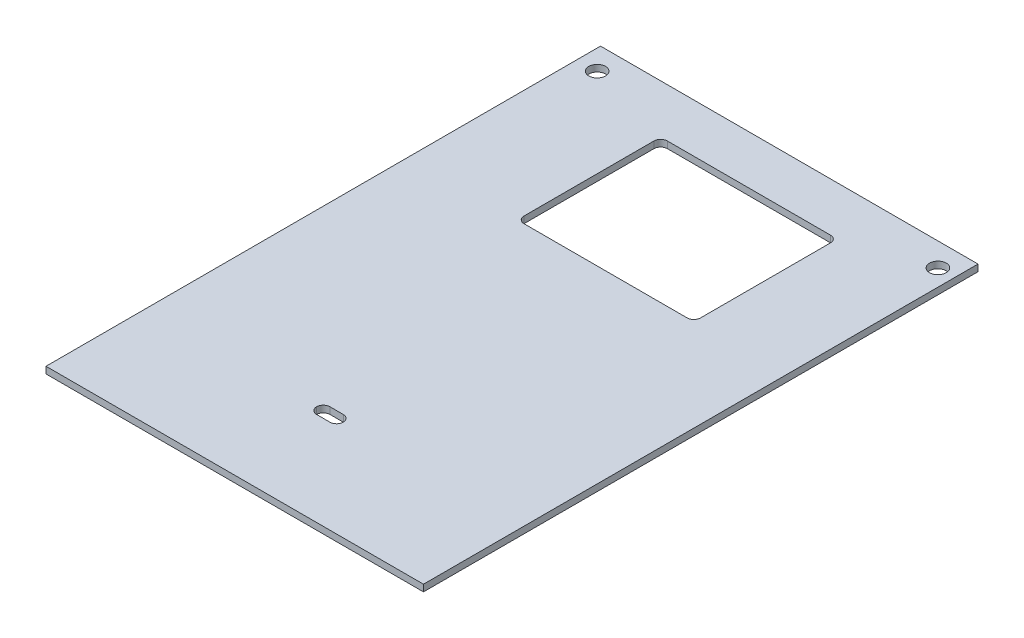
ISO-10303-21;
HEADER;
FILE_DESCRIPTION(('STEP AP214'),'2;1');
FILE_NAME('part.step','',(''),(''),'','','');
FILE_SCHEMA(('AUTOMOTIVE_DESIGN { 1 0 10303 214 1 1 1 1 }'));
ENDSEC;
DATA;
#1=APPLICATION_CONTEXT('core data for automotive mechanical design processes');
#2=APPLICATION_PROTOCOL_DEFINITION('international standard','automotive_design',2000,#1);
#3=PRODUCT_CONTEXT('',#1,'mechanical');
#4=PRODUCT('Part','Part','',(#3));
#5=PRODUCT_RELATED_PRODUCT_CATEGORY('part','',(#4));
#6=PRODUCT_DEFINITION_FORMATION('','',#4);
#7=PRODUCT_DEFINITION_CONTEXT('part definition',#1,'design');
#8=PRODUCT_DEFINITION('design','',#6,#7);
#9=PRODUCT_DEFINITION_SHAPE('','',#8);
#10=(LENGTH_UNIT() NAMED_UNIT(*) SI_UNIT(.MILLI.,.METRE.));
#11=(NAMED_UNIT(*) PLANE_ANGLE_UNIT() SI_UNIT($,.RADIAN.));
#12=(NAMED_UNIT(*) SI_UNIT($,.STERADIAN.) SOLID_ANGLE_UNIT());
#13=UNCERTAINTY_MEASURE_WITH_UNIT(LENGTH_MEASURE(1.E-05),#10,'distance_accuracy_value','');
#14=(GEOMETRIC_REPRESENTATION_CONTEXT(3) GLOBAL_UNCERTAINTY_ASSIGNED_CONTEXT((#13)) GLOBAL_UNIT_ASSIGNED_CONTEXT((#10,
#11,#12)) REPRESENTATION_CONTEXT('',''));
#15=CARTESIAN_POINT('',(0.,0.,0.));
#16=DIRECTION('',(0.,0.,1.));
#17=DIRECTION('',(1.,0.,0.));
#18=AXIS2_PLACEMENT_3D('',#15,#16,#17);
#19=CARTESIAN_POINT('',(-28.5,-10.,15.5796527090027));
#20=DIRECTION('',(0.,0.,-1.));
#21=DIRECTION('',(-1.,0.,0.));
#22=AXIS2_PLACEMENT_3D('',#19,#20,#21);
#23=PLANE('',#22);
#24=CARTESIAN_POINT('',(-24.5,-4.,15.5796527090027));
#25=DIRECTION('',(0.,0.,-1.));
#26=DIRECTION('',(-1.,0.,0.));
#27=AXIS2_PLACEMENT_3D('',#24,#25,#26);
#28=CIRCLE('',#27,2.);
#29=CARTESIAN_POINT('',(-26.5,-4.,15.5796527090027));
#30=VERTEX_POINT('',#29);
#31=EDGE_CURVE('E477',#30,#30,#28,.T.);
#32=ORIENTED_EDGE('',*,*,#31,.T.);
#33=EDGE_LOOP('',(#32));
#34=FACE_BOUND('',#33,.T.);
#35=DIRECTION('',(-1.,0.,0.));
#36=VECTOR('',#35,1.);
#37=CARTESIAN_POINT('',(-28.5,-10.,15.5796527090027));
#38=LINE('',#37,#36);
#39=CARTESIAN_POINT('',(-25.2721157321461,-10.,15.5796527090027));
#40=VERTEX_POINT('',#39);
#41=CARTESIAN_POINT('',(-28.5,-10.,15.5796527090027));
#42=VERTEX_POINT('',#41);
#43=EDGE_CURVE('E444',#40,#42,#38,.T.);
#44=ORIENTED_EDGE('',*,*,#43,.F.);
#45=CARTESIAN_POINT('',(-8.53891520146462,-19.,15.5796527090027));
#46=DIRECTION('',(0.,0.,1.));
#47=DIRECTION('',(1.,0.,0.));
#48=AXIS2_PLACEMENT_3D('',#45,#46,#47);
#49=CIRCLE('',#48,19.);
#50=CARTESIAN_POINT('',(-8.53891520146462,0.,15.5796527090027));
#51=VERTEX_POINT('',#50);
#52=EDGE_CURVE('E211',#51,#40,#49,.T.);
#53=ORIENTED_EDGE('',*,*,#52,.F.);
#54=DIRECTION('',(-1.,0.,0.));
#55=VECTOR('',#54,1.);
#56=CARTESIAN_POINT('',(-28.5,0.,15.5796527090027));
#57=LINE('',#56,#55);
#58=CARTESIAN_POINT('',(-28.5,0.,15.5796527090027));
#59=VERTEX_POINT('',#58);
#60=EDGE_CURVE('E243',#51,#59,#57,.T.);
#61=ORIENTED_EDGE('',*,*,#60,.T.);
#62=DIRECTION('',(0.,1.,0.));
#63=VECTOR('',#62,1.);
#64=CARTESIAN_POINT('',(-28.5,-10.,15.5796527090027));
#65=LINE('',#64,#63);
#66=EDGE_CURVE('E254',#42,#59,#65,.T.);
#67=ORIENTED_EDGE('',*,*,#66,.F.);
#68=EDGE_LOOP('',(#44,#53,#61,#67));
#69=FACE_BOUND('',#68,.T.);
#70=ADVANCED_FACE('F39',(#34,#69),#23,.F.);
#71=CARTESIAN_POINT('',(-28.5,-10.,10.5796527090027));
#72=DIRECTION('',(0.,0.,1.));
#73=DIRECTION('',(1.,0.,0.));
#74=AXIS2_PLACEMENT_3D('',#71,#72,#73);
#75=PLANE('',#74);
#76=CARTESIAN_POINT('',(7.49999999999998,-4.,10.5796527090027));
#77=DIRECTION('',(0.,0.,1.));
#78=DIRECTION('',(1.,0.,0.));
#79=AXIS2_PLACEMENT_3D('',#76,#77,#78);
#80=CIRCLE('',#79,2.);
#81=CARTESIAN_POINT('',(9.49999999999998,-4.,10.5796527090027));
#82=VERTEX_POINT('',#81);
#83=EDGE_CURVE('E216',#82,#82,#80,.F.);
#84=ORIENTED_EDGE('',*,*,#83,.F.);
#85=EDGE_LOOP('',(#84));
#86=FACE_BOUND('',#85,.T.);
#87=DIRECTION('',(1.,0.,0.));
#88=VECTOR('',#87,1.);
#89=CARTESIAN_POINT('',(-28.5,-10.,10.5796527090027));
#90=LINE('',#89,#88);
#91=CARTESIAN_POINT('',(8.19428532921689,-10.,10.5796527090027));
#92=VERTEX_POINT('',#91);
#93=CARTESIAN_POINT('',(11.5,-10.,10.5796527090027));
#94=VERTEX_POINT('',#93);
#95=EDGE_CURVE('E233',#92,#94,#90,.T.);
#96=ORIENTED_EDGE('',*,*,#95,.F.);
#97=CARTESIAN_POINT('',(-8.53891520146462,-19.,10.5796527090027));
#98=DIRECTION('',(0.,0.,1.));
#99=DIRECTION('',(1.,0.,0.));
#100=AXIS2_PLACEMENT_3D('',#97,#98,#99);
#101=CIRCLE('',#100,19.);
#102=CARTESIAN_POINT('',(-8.53891520146462,0.,10.5796527090027));
#103=VERTEX_POINT('',#102);
#104=EDGE_CURVE('E226',#103,#92,#101,.F.);
#105=ORIENTED_EDGE('',*,*,#104,.F.);
#106=DIRECTION('',(1.,0.,0.));
#107=VECTOR('',#106,1.);
#108=CARTESIAN_POINT('',(-28.5,0.,10.5796527090027));
#109=LINE('',#108,#107);
#110=CARTESIAN_POINT('',(11.5,0.,10.5796527090027));
#111=VERTEX_POINT('',#110);
#112=EDGE_CURVE('E250',#103,#111,#109,.T.);
#113=ORIENTED_EDGE('',*,*,#112,.T.);
#114=DIRECTION('',(0.,1.,0.));
#115=VECTOR('',#114,1.);
#116=CARTESIAN_POINT('',(11.5,-10.,10.5796527090027));
#117=LINE('',#116,#115);
#118=EDGE_CURVE('E232',#94,#111,#117,.T.);
#119=ORIENTED_EDGE('',*,*,#118,.F.);
#120=EDGE_LOOP('',(#96,#105,#113,#119));
#121=FACE_BOUND('',#120,.T.);
#122=ADVANCED_FACE('F404',(#86,#121),#75,.F.);
#123=CARTESIAN_POINT('',(0.,-10.,0.));
#124=DIRECTION('',(0.,-1.,0.));
#125=DIRECTION('',(0.,0.,-1.));
#126=AXIS2_PLACEMENT_3D('',#123,#124,#125);
#127=PLANE('',#126);
#128=DIRECTION('',(0.,0.,1.));
#129=VECTOR('',#128,1.);
#130=CARTESIAN_POINT('',(8.19428532921689,-10.,-83.001));
#131=LINE('',#130,#129);
#132=CARTESIAN_POINT('',(8.19428532921689,-10.,15.5796527090027));
#133=VERTEX_POINT('',#132);
#134=EDGE_CURVE('E215',#133,#92,#131,.F.);
#135=ORIENTED_EDGE('',*,*,#134,.T.);
#136=ORIENTED_EDGE('',*,*,#95,.T.);
#137=DIRECTION('',(0.,0.,1.));
#138=VECTOR('',#137,1.);
#139=CARTESIAN_POINT('',(11.5,-10.,15.5796527090027));
#140=LINE('',#139,#138);
#141=CARTESIAN_POINT('',(11.5,-10.,15.5796527090027));
#142=VERTEX_POINT('',#141);
#143=EDGE_CURVE('E251',#94,#142,#140,.T.);
#144=ORIENTED_EDGE('',*,*,#143,.T.);
#145=EDGE_CURVE('E450',#142,#133,#38,.T.);
#146=ORIENTED_EDGE('',*,*,#145,.T.);
#147=EDGE_LOOP('',(#135,#136,#144,#146));
#148=FACE_BOUND('',#147,.T.);
#149=ADVANCED_FACE('F412',(#148),#127,.T.);
#150=CARTESIAN_POINT('',(0.,0.,0.));
#151=DIRECTION('',(0.,1.,0.));
#152=DIRECTION('',(0.,0.,1.));
#153=AXIS2_PLACEMENT_3D('',#150,#151,#152);
#154=PLANE('',#153);
#155=DIRECTION('',(-1.,0.,0.));
#156=VECTOR('',#155,1.);
#157=CARTESIAN_POINT('',(28.9365936068271,0.,-25.5));
#158=LINE('',#157,#156);
#159=CARTESIAN_POINT('',(26.9365936068271,0.,-25.5));
#160=VERTEX_POINT('',#159);
#161=CARTESIAN_POINT('',(-21.9083088951167,0.,-25.5));
#162=VERTEX_POINT('',#161);
#163=EDGE_CURVE('E390',#160,#162,#158,.T.);
#164=ORIENTED_EDGE('',*,*,#163,.F.);
#165=CARTESIAN_POINT('',(26.9365936068271,0.,-27.5));
#166=DIRECTION('',(0.,1.,0.));
#167=DIRECTION('',(0.,0.,1.));
#168=AXIS2_PLACEMENT_3D('',#165,#166,#167);
#169=CIRCLE('',#168,2.);
#170=CARTESIAN_POINT('',(28.9365936068271,0.,-27.5));
#171=VERTEX_POINT('',#170);
#172=EDGE_CURVE('E367',#160,#171,#169,.T.);
#173=ORIENTED_EDGE('',*,*,#172,.T.);
#174=DIRECTION('',(0.,0.,1.));
#175=VECTOR('',#174,1.);
#176=CARTESIAN_POINT('',(28.9365936068271,0.,-68.4141095634092));
#177=LINE('',#176,#175);
#178=CARTESIAN_POINT('',(28.9365936068271,0.,-66.4141095634092));
#179=VERTEX_POINT('',#178);
#180=EDGE_CURVE('E523',#179,#171,#177,.T.);
#181=ORIENTED_EDGE('',*,*,#180,.F.);
#182=CARTESIAN_POINT('',(26.9365936068271,0.,-66.4141095634092));
#183=DIRECTION('',(0.,1.,0.));
#184=DIRECTION('',(0.,0.,1.));
#185=AXIS2_PLACEMENT_3D('',#182,#183,#184);
#186=CIRCLE('',#185,2.);
#187=CARTESIAN_POINT('',(26.9365936068271,0.,-68.4141095634092));
#188=VERTEX_POINT('',#187);
#189=EDGE_CURVE('E371',#179,#188,#186,.T.);
#190=ORIENTED_EDGE('',*,*,#189,.T.);
#191=DIRECTION('',(1.,0.,0.));
#192=VECTOR('',#191,1.);
#193=CARTESIAN_POINT('',(28.9365936068271,0.,-68.4141095634092));
#194=LINE('',#193,#192);
#195=CARTESIAN_POINT('',(-21.9083088951167,0.,-68.4141095634092));
#196=VERTEX_POINT('',#195);
#197=EDGE_CURVE('E386',#196,#188,#194,.T.);
#198=ORIENTED_EDGE('',*,*,#197,.F.);
#199=CARTESIAN_POINT('',(-21.9083088951167,0.,-66.4141095634092));
#200=DIRECTION('',(0.,1.,0.));
#201=DIRECTION('',(0.,0.,1.));
#202=AXIS2_PLACEMENT_3D('',#199,#200,#201);
#203=CIRCLE('',#202,2.);
#204=CARTESIAN_POINT('',(-23.9083088951167,0.,-66.4141095634092));
#205=VERTEX_POINT('',#204);
#206=EDGE_CURVE('E374',#196,#205,#203,.T.);
#207=ORIENTED_EDGE('',*,*,#206,.T.);
#208=DIRECTION('',(0.,0.,-1.));
#209=VECTOR('',#208,1.);
#210=CARTESIAN_POINT('',(-23.9083088951167,0.,-68.4141095634092));
#211=LINE('',#210,#209);
#212=CARTESIAN_POINT('',(-23.9083088951167,0.,-27.5));
#213=VERTEX_POINT('',#212);
#214=EDGE_CURVE('E383',#213,#205,#211,.T.);
#215=ORIENTED_EDGE('',*,*,#214,.F.);
#216=CARTESIAN_POINT('',(-21.9083088951167,0.,-27.5));
#217=DIRECTION('',(0.,1.,0.));
#218=DIRECTION('',(0.,0.,1.));
#219=AXIS2_PLACEMENT_3D('',#216,#217,#218);
#220=CIRCLE('',#219,2.);
#221=EDGE_CURVE('E11',#213,#162,#220,.T.);
#222=ORIENTED_EDGE('',*,*,#221,.T.);
#223=EDGE_LOOP('',(#164,#173,#181,#190,#198,#207,#215,#222));
#224=FACE_BOUND('',#223,.T.);
#225=DIRECTION('',(0.,0.,-1.));
#226=VECTOR('',#225,1.);
#227=CARTESIAN_POINT('',(56.5,0.,-83.));
#228=LINE('',#227,#226);
#229=CARTESIAN_POINT('',(56.5,0.,83.));
#230=VERTEX_POINT('',#229);
#231=CARTESIAN_POINT('',(56.5,0.,-83.));
#232=VERTEX_POINT('',#231);
#233=EDGE_CURVE('E268',#230,#232,#228,.T.);
#234=ORIENTED_EDGE('',*,*,#233,.F.);
#235=DIRECTION('',(1.,0.,0.));
#236=VECTOR('',#235,1.);
#237=CARTESIAN_POINT('',(-56.5,0.,83.));
#238=LINE('',#237,#236);
#239=CARTESIAN_POINT('',(-56.5,0.,83.));
#240=VERTEX_POINT('',#239);
#241=EDGE_CURVE('E291',#240,#230,#238,.T.);
#242=ORIENTED_EDGE('',*,*,#241,.F.);
#243=DIRECTION('',(0.,0.,1.));
#244=VECTOR('',#243,1.);
#245=CARTESIAN_POINT('',(-56.5,0.,-83.));
#246=LINE('',#245,#244);
#247=CARTESIAN_POINT('',(-56.5,0.,-83.));
#248=VERTEX_POINT('',#247);
#249=EDGE_CURVE('E302',#248,#240,#246,.T.);
#250=ORIENTED_EDGE('',*,*,#249,.F.);
#251=DIRECTION('',(-1.,0.,0.));
#252=VECTOR('',#251,1.);
#253=CARTESIAN_POINT('',(-56.5,0.,-83.));
#254=LINE('',#253,#252);
#255=EDGE_CURVE('E300',#232,#248,#254,.T.);
#256=ORIENTED_EDGE('',*,*,#255,.F.);
#257=EDGE_LOOP('',(#234,#242,#250,#256));
#258=FACE_BOUND('',#257,.T.);
#259=CARTESIAN_POINT('',(0.499999999999992,0.,53.));
#260=DIRECTION('',(0.,1.,0.));
#261=DIRECTION('',(0.,0.,1.));
#262=AXIS2_PLACEMENT_3D('',#259,#260,#261);
#263=CIRCLE('',#262,2.);
#264=CARTESIAN_POINT('',(0.499999999999993,0.,55.));
#265=VERTEX_POINT('',#264);
#266=CARTESIAN_POINT('',(2.49999999999999,0.,53.));
#267=VERTEX_POINT('',#266);
#268=EDGE_CURVE('E336',#265,#267,#263,.T.);
#269=ORIENTED_EDGE('',*,*,#268,.T.);
#270=CARTESIAN_POINT('',(0.499999999999992,0.,53.));
#271=DIRECTION('',(0.,1.,0.));
#272=DIRECTION('',(0.,0.,1.));
#273=AXIS2_PLACEMENT_3D('',#270,#271,#272);
#274=CIRCLE('',#273,2.);
#275=CARTESIAN_POINT('',(0.499999999999992,0.,51.));
#276=VERTEX_POINT('',#275);
#277=EDGE_CURVE('E340',#267,#276,#274,.T.);
#278=ORIENTED_EDGE('',*,*,#277,.T.);
#279=DIRECTION('',(1.,0.,0.));
#280=VECTOR('',#279,1.);
#281=CARTESIAN_POINT('',(-5.50000000000001,0.,51.));
#282=LINE('',#281,#280);
#283=CARTESIAN_POINT('',(-3.50000000000001,0.,51.));
#284=VERTEX_POINT('',#283);
#285=EDGE_CURVE('E275',#284,#276,#282,.T.);
#286=ORIENTED_EDGE('',*,*,#285,.F.);
#287=CARTESIAN_POINT('',(-3.50000000000001,0.,53.));
#288=DIRECTION('',(0.,1.,0.));
#289=DIRECTION('',(0.,0.,1.));
#290=AXIS2_PLACEMENT_3D('',#287,#288,#289);
#291=CIRCLE('',#290,2.);
#292=CARTESIAN_POINT('',(-5.50000000000001,0.,53.));
#293=VERTEX_POINT('',#292);
#294=EDGE_CURVE('E332',#284,#293,#291,.T.);
#295=ORIENTED_EDGE('',*,*,#294,.T.);
#296=CARTESIAN_POINT('',(-3.50000000000001,0.,53.));
#297=DIRECTION('',(0.,1.,0.));
#298=DIRECTION('',(0.,0.,1.));
#299=AXIS2_PLACEMENT_3D('',#296,#297,#298);
#300=CIRCLE('',#299,2.);
#301=CARTESIAN_POINT('',(-3.50000000000001,0.,55.));
#302=VERTEX_POINT('',#301);
#303=EDGE_CURVE('E328',#293,#302,#300,.T.);
#304=ORIENTED_EDGE('',*,*,#303,.T.);
#305=DIRECTION('',(-1.,0.,0.));
#306=VECTOR('',#305,1.);
#307=CARTESIAN_POINT('',(-5.50000000000001,0.,55.));
#308=LINE('',#307,#306);
#309=EDGE_CURVE('E272',#265,#302,#308,.T.);
#310=ORIENTED_EDGE('',*,*,#309,.F.);
#311=EDGE_LOOP('',(#269,#278,#286,#295,#304,#310));
#312=FACE_BOUND('',#311,.T.);
#313=CARTESIAN_POINT('',(-50.5,0.,-76.));
#314=DIRECTION('',(0.,1.,0.));
#315=DIRECTION('',(0.,0.,1.));
#316=AXIS2_PLACEMENT_3D('',#313,#314,#315);
#317=CIRCLE('',#316,2.5);
#318=CARTESIAN_POINT('',(-50.5,0.,-73.5));
#319=VERTEX_POINT('',#318);
#320=EDGE_CURVE('E269',#319,#319,#317,.F.);
#321=ORIENTED_EDGE('',*,*,#320,.F.);
#322=EDGE_LOOP('',(#321));
#323=FACE_BOUND('',#322,.T.);
#324=CARTESIAN_POINT('',(51.5,0.,-76.));
#325=DIRECTION('',(0.,1.,0.));
#326=DIRECTION('',(0.,0.,1.));
#327=AXIS2_PLACEMENT_3D('',#324,#325,#326);
#328=CIRCLE('',#327,2.5);
#329=CARTESIAN_POINT('',(51.5,0.,-73.5));
#330=VERTEX_POINT('',#329);
#331=EDGE_CURVE('E264',#330,#330,#328,.F.);
#332=ORIENTED_EDGE('',*,*,#331,.F.);
#333=EDGE_LOOP('',(#332));
#334=FACE_BOUND('',#333,.T.);
#335=DIRECTION('',(0.,0.,1.));
#336=VECTOR('',#335,1.);
#337=CARTESIAN_POINT('',(11.5,0.,15.5796527090027));
#338=LINE('',#337,#336);
#339=CARTESIAN_POINT('',(11.5,0.,15.5796527090027));
#340=VERTEX_POINT('',#339);
#341=EDGE_CURVE('E225',#111,#340,#338,.T.);
#342=ORIENTED_EDGE('',*,*,#341,.F.);
#343=ORIENTED_EDGE('',*,*,#112,.F.);
#344=CARTESIAN_POINT('',(-28.5,0.,10.5796527090027));
#345=VERTEX_POINT('',#344);
#346=EDGE_CURVE('E224',#345,#103,#109,.T.);
#347=ORIENTED_EDGE('',*,*,#346,.F.);
#348=DIRECTION('',(0.,0.,-1.));
#349=VECTOR('',#348,1.);
#350=CARTESIAN_POINT('',(-28.5,0.,15.5796527090027));
#351=LINE('',#350,#349);
#352=EDGE_CURVE('E247',#59,#345,#351,.T.);
#353=ORIENTED_EDGE('',*,*,#352,.F.);
#354=ORIENTED_EDGE('',*,*,#60,.F.);
#355=EDGE_CURVE('E244',#340,#51,#57,.T.);
#356=ORIENTED_EDGE('',*,*,#355,.F.);
#357=EDGE_LOOP('',(#342,#343,#347,#353,#354,#356));
#358=FACE_BOUND('',#357,.T.);
#359=ADVANCED_FACE('F381',(#224,#258,#312,#323,#334,#358),#154,.F.);
#360=CARTESIAN_POINT('',(56.5,2.,-83.));
#361=DIRECTION('',(-1.,0.,0.));
#362=DIRECTION('',(0.,0.,1.));
#363=AXIS2_PLACEMENT_3D('',#360,#361,#362);
#364=PLANE('',#363);
#365=ORIENTED_EDGE('',*,*,#233,.T.);
#366=DIRECTION('',(0.,-1.,0.));
#367=VECTOR('',#366,1.);
#368=CARTESIAN_POINT('',(56.5,2.,-83.));
#369=LINE('',#368,#367);
#370=CARTESIAN_POINT('',(56.5,2.,-83.));
#371=VERTEX_POINT('',#370);
#372=EDGE_CURVE('E313',#371,#232,#369,.T.);
#373=ORIENTED_EDGE('',*,*,#372,.F.);
#374=DIRECTION('',(0.,0.,-1.));
#375=VECTOR('',#374,1.);
#376=CARTESIAN_POINT('',(56.5,2.,-83.));
#377=LINE('',#376,#375);
#378=CARTESIAN_POINT('',(56.5,2.,83.));
#379=VERTEX_POINT('',#378);
#380=EDGE_CURVE('E287',#379,#371,#377,.T.);
#381=ORIENTED_EDGE('',*,*,#380,.F.);
#382=DIRECTION('',(0.,-1.,0.));
#383=VECTOR('',#382,1.);
#384=CARTESIAN_POINT('',(56.5,2.,83.));
#385=LINE('',#384,#383);
#386=EDGE_CURVE('E297',#379,#230,#385,.T.);
#387=ORIENTED_EDGE('',*,*,#386,.T.);
#388=EDGE_LOOP('',(#365,#373,#381,#387));
#389=FACE_BOUND('',#388,.T.);
#390=ADVANCED_FACE('F461',(#389),#364,.F.);
#391=CARTESIAN_POINT('',(-56.5,2.,-83.));
#392=DIRECTION('',(0.,0.,1.));
#393=DIRECTION('',(1.,0.,0.));
#394=AXIS2_PLACEMENT_3D('',#391,#392,#393);
#395=PLANE('',#394);
#396=ORIENTED_EDGE('',*,*,#255,.T.);
#397=DIRECTION('',(0.,-1.,0.));
#398=VECTOR('',#397,1.);
#399=CARTESIAN_POINT('',(-56.5,2.,-83.));
#400=LINE('',#399,#398);
#401=CARTESIAN_POINT('',(-56.5,2.,-83.));
#402=VERTEX_POINT('',#401);
#403=EDGE_CURVE('E310',#402,#248,#400,.T.);
#404=ORIENTED_EDGE('',*,*,#403,.F.);
#405=DIRECTION('',(-1.,0.,0.));
#406=VECTOR('',#405,1.);
#407=CARTESIAN_POINT('',(-56.5,2.,-83.));
#408=LINE('',#407,#406);
#409=EDGE_CURVE('E290',#371,#402,#408,.T.);
#410=ORIENTED_EDGE('',*,*,#409,.F.);
#411=ORIENTED_EDGE('',*,*,#372,.T.);
#412=EDGE_LOOP('',(#396,#404,#410,#411));
#413=FACE_BOUND('',#412,.T.);
#414=ADVANCED_FACE('F559',(#413),#395,.F.);
#415=CARTESIAN_POINT('',(-56.5,2.,-83.));
#416=DIRECTION('',(1.,0.,0.));
#417=DIRECTION('',(0.,0.,-1.));
#418=AXIS2_PLACEMENT_3D('',#415,#416,#417);
#419=PLANE('',#418);
#420=ORIENTED_EDGE('',*,*,#249,.T.);
#421=DIRECTION('',(0.,-1.,0.));
#422=VECTOR('',#421,1.);
#423=CARTESIAN_POINT('',(-56.5,2.,83.));
#424=LINE('',#423,#422);
#425=CARTESIAN_POINT('',(-56.5,2.,83.));
#426=VERTEX_POINT('',#425);
#427=EDGE_CURVE('E307',#426,#240,#424,.T.);
#428=ORIENTED_EDGE('',*,*,#427,.F.);
#429=DIRECTION('',(0.,0.,1.));
#430=VECTOR('',#429,1.);
#431=CARTESIAN_POINT('',(-56.5,2.,-83.));
#432=LINE('',#431,#430);
#433=EDGE_CURVE('E293',#402,#426,#432,.T.);
#434=ORIENTED_EDGE('',*,*,#433,.F.);
#435=ORIENTED_EDGE('',*,*,#403,.T.);
#436=EDGE_LOOP('',(#420,#428,#434,#435));
#437=FACE_BOUND('',#436,.T.);
#438=ADVANCED_FACE('F564',(#437),#419,.F.);
#439=CARTESIAN_POINT('',(-56.5,2.,83.));
#440=DIRECTION('',(0.,0.,-1.));
#441=DIRECTION('',(-1.,0.,0.));
#442=AXIS2_PLACEMENT_3D('',#439,#440,#441);
#443=PLANE('',#442);
#444=ORIENTED_EDGE('',*,*,#241,.T.);
#445=ORIENTED_EDGE('',*,*,#386,.F.);
#446=DIRECTION('',(1.,0.,0.));
#447=VECTOR('',#446,1.);
#448=CARTESIAN_POINT('',(-56.5,2.,83.));
#449=LINE('',#448,#447);
#450=EDGE_CURVE('E295',#426,#379,#449,.T.);
#451=ORIENTED_EDGE('',*,*,#450,.F.);
#452=ORIENTED_EDGE('',*,*,#427,.T.);
#453=EDGE_LOOP('',(#444,#445,#451,#452));
#454=FACE_BOUND('',#453,.T.);
#455=ADVANCED_FACE('F542',(#454),#443,.F.);
#456=CARTESIAN_POINT('',(0.,2.,0.));
#457=DIRECTION('',(0.,1.,0.));
#458=DIRECTION('',(0.,0.,1.));
#459=AXIS2_PLACEMENT_3D('',#456,#457,#458);
#460=PLANE('',#459);
#461=DIRECTION('',(0.,0.,-1.));
#462=VECTOR('',#461,1.);
#463=CARTESIAN_POINT('',(28.9365936068271,2.,-68.4141095634092));
#464=LINE('',#463,#462);
#465=CARTESIAN_POINT('',(28.9365936068271,2.,-27.5));
#466=VERTEX_POINT('',#465);
#467=CARTESIAN_POINT('',(28.9365936068271,2.,-66.4141095634092));
#468=VERTEX_POINT('',#467);
#469=EDGE_CURVE('E528',#466,#468,#464,.T.);
#470=ORIENTED_EDGE('',*,*,#469,.F.);
#471=CARTESIAN_POINT('',(26.9365936068271,2.,-27.5));
#472=DIRECTION('',(0.,1.,0.));
#473=DIRECTION('',(0.,0.,1.));
#474=AXIS2_PLACEMENT_3D('',#471,#472,#473);
#475=CIRCLE('',#474,2.);
#476=CARTESIAN_POINT('',(26.9365936068271,2.,-25.5));
#477=VERTEX_POINT('',#476);
#478=EDGE_CURVE('E365',#466,#477,#475,.F.);
#479=ORIENTED_EDGE('',*,*,#478,.T.);
#480=DIRECTION('',(1.,0.,0.));
#481=VECTOR('',#480,1.);
#482=CARTESIAN_POINT('',(28.9365936068271,2.,-25.5));
#483=LINE('',#482,#481);
#484=CARTESIAN_POINT('',(-21.9083088951167,2.,-25.5));
#485=VERTEX_POINT('',#484);
#486=EDGE_CURVE('E480',#485,#477,#483,.T.);
#487=ORIENTED_EDGE('',*,*,#486,.F.);
#488=CARTESIAN_POINT('',(-21.9083088951167,2.,-27.5));
#489=DIRECTION('',(0.,1.,0.));
#490=DIRECTION('',(0.,0.,1.));
#491=AXIS2_PLACEMENT_3D('',#488,#489,#490);
#492=CIRCLE('',#491,2.);
#493=CARTESIAN_POINT('',(-23.9083088951167,2.,-27.5));
#494=VERTEX_POINT('',#493);
#495=EDGE_CURVE('E47',#485,#494,#492,.F.);
#496=ORIENTED_EDGE('',*,*,#495,.T.);
#497=DIRECTION('',(0.,0.,1.));
#498=VECTOR('',#497,1.);
#499=CARTESIAN_POINT('',(-23.9083088951167,2.,-68.4141095634092));
#500=LINE('',#499,#498);
#501=CARTESIAN_POINT('',(-23.9083088951167,2.,-66.4141095634092));
#502=VERTEX_POINT('',#501);
#503=EDGE_CURVE('E516',#502,#494,#500,.T.);
#504=ORIENTED_EDGE('',*,*,#503,.F.);
#505=CARTESIAN_POINT('',(-21.9083088951167,2.,-66.4141095634092));
#506=DIRECTION('',(0.,1.,0.));
#507=DIRECTION('',(0.,0.,1.));
#508=AXIS2_PLACEMENT_3D('',#505,#506,#507);
#509=CIRCLE('',#508,2.);
#510=CARTESIAN_POINT('',(-21.9083088951167,2.,-68.4141095634092));
#511=VERTEX_POINT('',#510);
#512=EDGE_CURVE('E61',#502,#511,#509,.F.);
#513=ORIENTED_EDGE('',*,*,#512,.T.);
#514=DIRECTION('',(-1.,0.,0.));
#515=VECTOR('',#514,1.);
#516=CARTESIAN_POINT('',(28.9365936068271,2.,-68.4141095634092));
#517=LINE('',#516,#515);
#518=CARTESIAN_POINT('',(26.9365936068271,2.,-68.4141095634092));
#519=VERTEX_POINT('',#518);
#520=EDGE_CURVE('E530',#519,#511,#517,.T.);
#521=ORIENTED_EDGE('',*,*,#520,.F.);
#522=CARTESIAN_POINT('',(26.9365936068271,2.,-66.4141095634092));
#523=DIRECTION('',(0.,1.,0.));
#524=DIRECTION('',(0.,0.,1.));
#525=AXIS2_PLACEMENT_3D('',#522,#523,#524);
#526=CIRCLE('',#525,2.);
#527=EDGE_CURVE('E369',#519,#468,#526,.F.);
#528=ORIENTED_EDGE('',*,*,#527,.T.);
#529=EDGE_LOOP('',(#470,#479,#487,#496,#504,#513,#521,#528));
#530=FACE_BOUND('',#529,.T.);
#531=CARTESIAN_POINT('',(51.5,2.,-76.));
#532=DIRECTION('',(0.,1.,0.));
#533=DIRECTION('',(0.,0.,1.));
#534=AXIS2_PLACEMENT_3D('',#531,#532,#533);
#535=CIRCLE('',#534,2.5);
#536=CARTESIAN_POINT('',(51.5,2.,-73.5));
#537=VERTEX_POINT('',#536);
#538=EDGE_CURVE('E261',#537,#537,#535,.T.);
#539=ORIENTED_EDGE('',*,*,#538,.F.);
#540=EDGE_LOOP('',(#539));
#541=FACE_BOUND('',#540,.T.);
#542=CARTESIAN_POINT('',(-50.5,2.,-76.));
#543=DIRECTION('',(0.,1.,0.));
#544=DIRECTION('',(0.,0.,1.));
#545=AXIS2_PLACEMENT_3D('',#542,#543,#544);
#546=CIRCLE('',#545,2.5);
#547=CARTESIAN_POINT('',(-50.5,2.,-73.5));
#548=VERTEX_POINT('',#547);
#549=EDGE_CURVE('E265',#548,#548,#546,.T.);
#550=ORIENTED_EDGE('',*,*,#549,.F.);
#551=EDGE_LOOP('',(#550));
#552=FACE_BOUND('',#551,.T.);
#553=DIRECTION('',(-1.,0.,0.));
#554=VECTOR('',#553,1.);
#555=CARTESIAN_POINT('',(-5.50000000000001,2.,51.));
#556=LINE('',#555,#554);
#557=CARTESIAN_POINT('',(0.499999999999992,2.,51.));
#558=VERTEX_POINT('',#557);
#559=CARTESIAN_POINT('',(-3.50000000000001,2.,51.));
#560=VERTEX_POINT('',#559);
#561=EDGE_CURVE('E282',#558,#560,#556,.T.);
#562=ORIENTED_EDGE('',*,*,#561,.F.);
#563=CARTESIAN_POINT('',(0.499999999999992,2.,53.));
#564=DIRECTION('',(0.,1.,0.));
#565=DIRECTION('',(0.,0.,1.));
#566=AXIS2_PLACEMENT_3D('',#563,#564,#565);
#567=CIRCLE('',#566,2.);
#568=CARTESIAN_POINT('',(2.49999999999999,2.,53.));
#569=VERTEX_POINT('',#568);
#570=EDGE_CURVE('E338',#558,#569,#567,.F.);
#571=ORIENTED_EDGE('',*,*,#570,.T.);
#572=CARTESIAN_POINT('',(0.499999999999992,2.,53.));
#573=DIRECTION('',(0.,1.,0.));
#574=DIRECTION('',(0.,0.,1.));
#575=AXIS2_PLACEMENT_3D('',#572,#573,#574);
#576=CIRCLE('',#575,2.);
#577=CARTESIAN_POINT('',(0.499999999999993,2.,55.));
#578=VERTEX_POINT('',#577);
#579=EDGE_CURVE('E334',#569,#578,#576,.F.);
#580=ORIENTED_EDGE('',*,*,#579,.T.);
#581=DIRECTION('',(1.,0.,0.));
#582=VECTOR('',#581,1.);
#583=CARTESIAN_POINT('',(-5.50000000000001,2.,55.));
#584=LINE('',#583,#582);
#585=CARTESIAN_POINT('',(-3.50000000000001,2.,55.));
#586=VERTEX_POINT('',#585);
#587=EDGE_CURVE('E278',#586,#578,#584,.T.);
#588=ORIENTED_EDGE('',*,*,#587,.F.);
#589=CARTESIAN_POINT('',(-3.50000000000001,2.,53.));
#590=DIRECTION('',(0.,1.,0.));
#591=DIRECTION('',(0.,0.,1.));
#592=AXIS2_PLACEMENT_3D('',#589,#590,#591);
#593=CIRCLE('',#592,2.);
#594=CARTESIAN_POINT('',(-5.50000000000001,2.,53.));
#595=VERTEX_POINT('',#594);
#596=EDGE_CURVE('E326',#586,#595,#593,.F.);
#597=ORIENTED_EDGE('',*,*,#596,.T.);
#598=CARTESIAN_POINT('',(-3.50000000000001,2.,53.));
#599=DIRECTION('',(0.,1.,0.));
#600=DIRECTION('',(0.,0.,1.));
#601=AXIS2_PLACEMENT_3D('',#598,#599,#600);
#602=CIRCLE('',#601,2.);
#603=EDGE_CURVE('E330',#595,#560,#602,.F.);
#604=ORIENTED_EDGE('',*,*,#603,.T.);
#605=EDGE_LOOP('',(#562,#571,#580,#588,#597,#604));
#606=FACE_BOUND('',#605,.T.);
#607=ORIENTED_EDGE('',*,*,#380,.T.);
#608=ORIENTED_EDGE('',*,*,#409,.T.);
#609=ORIENTED_EDGE('',*,*,#433,.T.);
#610=ORIENTED_EDGE('',*,*,#450,.T.);
#611=EDGE_LOOP('',(#607,#608,#609,#610));
#612=FACE_BOUND('',#611,.T.);
#613=ADVANCED_FACE('F536',(#530,#541,#552,#606,#612),#460,.T.);
#614=CARTESIAN_POINT('',(-5.50000000000001,-0.00100000000000013,55.));
#615=DIRECTION('',(0.,0.,1.));
#616=DIRECTION('',(1.,0.,0.));
#617=AXIS2_PLACEMENT_3D('',#614,#615,#616);
#618=PLANE('',#617);
#619=ORIENTED_EDGE('',*,*,#309,.T.);
#620=DIRECTION('',(0.,1.,0.));
#621=VECTOR('',#620,1.);
#622=CARTESIAN_POINT('',(-3.50000000000001,2.,55.));
#623=LINE('',#622,#621);
#624=EDGE_CURVE('E319',#302,#586,#623,.T.);
#625=ORIENTED_EDGE('',*,*,#624,.T.);
#626=ORIENTED_EDGE('',*,*,#587,.T.);
#627=DIRECTION('',(0.,1.,0.));
#628=VECTOR('',#627,1.);
#629=CARTESIAN_POINT('',(0.499999999999992,0.,55.));
#630=LINE('',#629,#628);
#631=EDGE_CURVE('E316',#578,#265,#630,.F.);
#632=ORIENTED_EDGE('',*,*,#631,.T.);
#633=EDGE_LOOP('',(#619,#625,#626,#632));
#634=FACE_BOUND('',#633,.T.);
#635=ADVANCED_FACE('F541',(#634),#618,.F.);
#636=CARTESIAN_POINT('',(-5.50000000000001,-0.00100000000000013,51.));
#637=DIRECTION('',(0.,0.,-1.));
#638=DIRECTION('',(-1.,0.,0.));
#639=AXIS2_PLACEMENT_3D('',#636,#637,#638);
#640=PLANE('',#639);
#641=ORIENTED_EDGE('',*,*,#561,.T.);
#642=DIRECTION('',(0.,1.,0.));
#643=VECTOR('',#642,1.);
#644=CARTESIAN_POINT('',(-3.50000000000001,0.,51.));
#645=LINE('',#644,#643);
#646=EDGE_CURVE('E324',#560,#284,#645,.F.);
#647=ORIENTED_EDGE('',*,*,#646,.T.);
#648=ORIENTED_EDGE('',*,*,#285,.T.);
#649=DIRECTION('',(0.,1.,0.));
#650=VECTOR('',#649,1.);
#651=CARTESIAN_POINT('',(0.499999999999992,2.,51.));
#652=LINE('',#651,#650);
#653=EDGE_CURVE('E322',#276,#558,#652,.T.);
#654=ORIENTED_EDGE('',*,*,#653,.T.);
#655=EDGE_LOOP('',(#641,#647,#648,#654));
#656=FACE_BOUND('',#655,.T.);
#657=ADVANCED_FACE('F588',(#656),#640,.F.);
#658=CARTESIAN_POINT('',(-50.5,-0.00100000000000013,-76.));
#659=DIRECTION('',(0.,1.,0.));
#660=DIRECTION('',(0.,0.,1.));
#661=AXIS2_PLACEMENT_3D('',#658,#659,#660);
#662=CYLINDRICAL_SURFACE('',#661,2.5);
#663=ORIENTED_EDGE('',*,*,#549,.T.);
#664=EDGE_LOOP('',(#663));
#665=FACE_BOUND('',#664,.T.);
#666=ORIENTED_EDGE('',*,*,#320,.T.);
#667=EDGE_LOOP('',(#666));
#668=FACE_BOUND('',#667,.T.);
#669=ADVANCED_FACE('F578',(#665,#668),#662,.F.);
#670=CARTESIAN_POINT('',(51.5,-0.00100000000000013,-76.));
#671=DIRECTION('',(0.,1.,0.));
#672=DIRECTION('',(0.,0.,1.));
#673=AXIS2_PLACEMENT_3D('',#670,#671,#672);
#674=CYLINDRICAL_SURFACE('',#673,2.5);
#675=ORIENTED_EDGE('',*,*,#538,.T.);
#676=EDGE_LOOP('',(#675));
#677=FACE_BOUND('',#676,.T.);
#678=ORIENTED_EDGE('',*,*,#331,.T.);
#679=EDGE_LOOP('',(#678));
#680=FACE_BOUND('',#679,.T.);
#681=ADVANCED_FACE('F575',(#677,#680),#674,.F.);
#682=CARTESIAN_POINT('',(-3.50000000000001,-0.00100000000000013,53.));
#683=DIRECTION('',(0.,-1.,0.));
#684=DIRECTION('',(0.,0.,-1.));
#685=AXIS2_PLACEMENT_3D('',#682,#683,#684);
#686=CYLINDRICAL_SURFACE('',#685,2.);
#687=DIRECTION('',(0.,1.,0.));
#688=VECTOR('',#687,1.);
#689=CARTESIAN_POINT('',(-5.50000000000001,2.,53.));
#690=LINE('',#689,#688);
#691=EDGE_CURVE('E279',#293,#595,#690,.T.);
#692=ORIENTED_EDGE('',*,*,#691,.F.);
#693=ORIENTED_EDGE('',*,*,#294,.F.);
#694=ORIENTED_EDGE('',*,*,#646,.F.);
#695=ORIENTED_EDGE('',*,*,#603,.F.);
#696=EDGE_LOOP('',(#692,#693,#694,#695));
#697=FACE_BOUND('',#696,.T.);
#698=ADVANCED_FACE('F577',(#697),#686,.F.);
#699=CARTESIAN_POINT('',(-3.50000000000001,-0.00100000000000013,53.));
#700=DIRECTION('',(0.,-1.,0.));
#701=DIRECTION('',(0.,0.,-1.));
#702=AXIS2_PLACEMENT_3D('',#699,#700,#701);
#703=CYLINDRICAL_SURFACE('',#702,2.);
#704=ORIENTED_EDGE('',*,*,#303,.F.);
#705=ORIENTED_EDGE('',*,*,#691,.T.);
#706=ORIENTED_EDGE('',*,*,#596,.F.);
#707=ORIENTED_EDGE('',*,*,#624,.F.);
#708=EDGE_LOOP('',(#704,#705,#706,#707));
#709=FACE_BOUND('',#708,.T.);
#710=ADVANCED_FACE('F585',(#709),#703,.F.);
#711=CARTESIAN_POINT('',(0.499999999999992,-0.00100000000000013,53.));
#712=DIRECTION('',(0.,-1.,0.));
#713=DIRECTION('',(0.,0.,-1.));
#714=AXIS2_PLACEMENT_3D('',#711,#712,#713);
#715=CYLINDRICAL_SURFACE('',#714,2.);
#716=ORIENTED_EDGE('',*,*,#653,.F.);
#717=ORIENTED_EDGE('',*,*,#277,.F.);
#718=DIRECTION('',(0.,1.,0.));
#719=VECTOR('',#718,1.);
#720=CARTESIAN_POINT('',(2.49999999999999,0.,53.));
#721=LINE('',#720,#719);
#722=EDGE_CURVE('E260',#569,#267,#721,.F.);
#723=ORIENTED_EDGE('',*,*,#722,.F.);
#724=ORIENTED_EDGE('',*,*,#570,.F.);
#725=EDGE_LOOP('',(#716,#717,#723,#724));
#726=FACE_BOUND('',#725,.T.);
#727=ADVANCED_FACE('F607',(#726),#715,.F.);
#728=CARTESIAN_POINT('',(0.499999999999992,-0.00100000000000013,53.));
#729=DIRECTION('',(0.,-1.,0.));
#730=DIRECTION('',(0.,0.,-1.));
#731=AXIS2_PLACEMENT_3D('',#728,#729,#730);
#732=CYLINDRICAL_SURFACE('',#731,2.);
#733=ORIENTED_EDGE('',*,*,#268,.F.);
#734=ORIENTED_EDGE('',*,*,#631,.F.);
#735=ORIENTED_EDGE('',*,*,#579,.F.);
#736=ORIENTED_EDGE('',*,*,#722,.T.);
#737=EDGE_LOOP('',(#733,#734,#735,#736));
#738=FACE_BOUND('',#737,.T.);
#739=ADVANCED_FACE('F428',(#738),#732,.F.);
#740=CARTESIAN_POINT('',(11.5,-10.,15.5796527090027));
#741=DIRECTION('',(-1.,0.,0.));
#742=DIRECTION('',(0.,0.,1.));
#743=AXIS2_PLACEMENT_3D('',#740,#741,#742);
#744=PLANE('',#743);
#745=ORIENTED_EDGE('',*,*,#341,.T.);
#746=DIRECTION('',(0.,1.,0.));
#747=VECTOR('',#746,1.);
#748=CARTESIAN_POINT('',(11.5,-10.,15.5796527090027));
#749=LINE('',#748,#747);
#750=EDGE_CURVE('E257',#142,#340,#749,.T.);
#751=ORIENTED_EDGE('',*,*,#750,.F.);
#752=ORIENTED_EDGE('',*,*,#143,.F.);
#753=ORIENTED_EDGE('',*,*,#118,.T.);
#754=EDGE_LOOP('',(#745,#751,#752,#753));
#755=FACE_BOUND('',#754,.T.);
#756=ADVANCED_FACE('F421',(#755),#744,.F.);
#757=CARTESIAN_POINT('',(7.49999999999998,-4.,15.5796527090027));
#758=DIRECTION('',(0.,0.,1.));
#759=DIRECTION('',(1.,0.,0.));
#760=AXIS2_PLACEMENT_3D('',#757,#758,#759);
#761=CIRCLE('',#760,2.);
#762=CARTESIAN_POINT('',(9.49999999999998,-4.,15.5796527090027));
#763=VERTEX_POINT('',#762);
#764=EDGE_CURVE('E433',#763,#763,#761,.T.);
#765=ORIENTED_EDGE('',*,*,#764,.F.);
#766=EDGE_LOOP('',(#765));
#767=FACE_BOUND('',#766,.T.);
#768=ORIENTED_EDGE('',*,*,#355,.T.);
#769=EDGE_CURVE('E435',#133,#51,#49,.T.);
#770=ORIENTED_EDGE('',*,*,#769,.F.);
#771=ORIENTED_EDGE('',*,*,#145,.F.);
#772=ORIENTED_EDGE('',*,*,#750,.T.);
#773=EDGE_LOOP('',(#768,#770,#771,#772));
#774=FACE_BOUND('',#773,.T.);
#775=ADVANCED_FACE('F407',(#767,#774),#23,.F.);
#776=CARTESIAN_POINT('',(-28.5,-10.,15.5796527090027));
#777=DIRECTION('',(1.,0.,0.));
#778=DIRECTION('',(0.,0.,-1.));
#779=AXIS2_PLACEMENT_3D('',#776,#777,#778);
#780=PLANE('',#779);
#781=ORIENTED_EDGE('',*,*,#352,.T.);
#782=DIRECTION('',(0.,1.,0.));
#783=VECTOR('',#782,1.);
#784=CARTESIAN_POINT('',(-28.5,-10.,10.5796527090027));
#785=LINE('',#784,#783);
#786=CARTESIAN_POINT('',(-28.5,-10.,10.5796527090027));
#787=VERTEX_POINT('',#786);
#788=EDGE_CURVE('E236',#787,#345,#785,.T.);
#789=ORIENTED_EDGE('',*,*,#788,.F.);
#790=DIRECTION('',(0.,0.,-1.));
#791=VECTOR('',#790,1.);
#792=CARTESIAN_POINT('',(-28.5,-10.,15.5796527090027));
#793=LINE('',#792,#791);
#794=EDGE_CURVE('E230',#42,#787,#793,.T.);
#795=ORIENTED_EDGE('',*,*,#794,.F.);
#796=ORIENTED_EDGE('',*,*,#66,.T.);
#797=EDGE_LOOP('',(#781,#789,#795,#796));
#798=FACE_BOUND('',#797,.T.);
#799=ADVANCED_FACE('F420',(#798),#780,.F.);
#800=CARTESIAN_POINT('',(-24.5,-4.,10.5796527090027));
#801=DIRECTION('',(0.,0.,1.));
#802=DIRECTION('',(1.,0.,0.));
#803=AXIS2_PLACEMENT_3D('',#800,#801,#802);
#804=CIRCLE('',#803,2.);
#805=CARTESIAN_POINT('',(-22.5,-4.,10.5796527090027));
#806=VERTEX_POINT('',#805);
#807=EDGE_CURVE('E475',#806,#806,#804,.T.);
#808=ORIENTED_EDGE('',*,*,#807,.T.);
#809=EDGE_LOOP('',(#808));
#810=FACE_BOUND('',#809,.T.);
#811=ORIENTED_EDGE('',*,*,#346,.T.);
#812=CARTESIAN_POINT('',(-25.2721157321461,-10.,10.5796527090027));
#813=VERTEX_POINT('',#812);
#814=EDGE_CURVE('E208',#813,#103,#101,.F.);
#815=ORIENTED_EDGE('',*,*,#814,.F.);
#816=EDGE_CURVE('E223',#787,#813,#90,.T.);
#817=ORIENTED_EDGE('',*,*,#816,.F.);
#818=ORIENTED_EDGE('',*,*,#788,.T.);
#819=EDGE_LOOP('',(#811,#815,#817,#818));
#820=FACE_BOUND('',#819,.T.);
#821=ADVANCED_FACE('F221',(#810,#820),#75,.F.);
#822=DIRECTION('',(0.,0.,1.));
#823=VECTOR('',#822,1.);
#824=CARTESIAN_POINT('',(-25.2721157321461,-10.,-83.001));
#825=LINE('',#824,#823);
#826=EDGE_CURVE('E205',#813,#40,#825,.T.);
#827=ORIENTED_EDGE('',*,*,#826,.T.);
#828=ORIENTED_EDGE('',*,*,#43,.T.);
#829=ORIENTED_EDGE('',*,*,#794,.T.);
#830=ORIENTED_EDGE('',*,*,#816,.T.);
#831=EDGE_LOOP('',(#827,#828,#829,#830));
#832=FACE_BOUND('',#831,.T.);
#833=ADVANCED_FACE('F228',(#832),#127,.T.);
#834=CARTESIAN_POINT('',(-8.53891520146462,-19.,-83.001));
#835=DIRECTION('',(0.,0.,1.));
#836=DIRECTION('',(1.,0.,0.));
#837=AXIS2_PLACEMENT_3D('',#834,#835,#836);
#838=CYLINDRICAL_SURFACE('',#837,19.);
#839=ORIENTED_EDGE('',*,*,#134,.F.);
#840=ORIENTED_EDGE('',*,*,#769,.T.);
#841=ORIENTED_EDGE('',*,*,#52,.T.);
#842=ORIENTED_EDGE('',*,*,#826,.F.);
#843=ORIENTED_EDGE('',*,*,#814,.T.);
#844=ORIENTED_EDGE('',*,*,#104,.T.);
#845=EDGE_LOOP('',(#839,#840,#841,#842,#843,#844));
#846=FACE_BOUND('',#845,.T.);
#847=ADVANCED_FACE('F207',(#846),#838,.F.);
#848=CARTESIAN_POINT('',(7.49999999999998,-4.,-83.001));
#849=DIRECTION('',(0.,0.,1.));
#850=DIRECTION('',(1.,0.,0.));
#851=AXIS2_PLACEMENT_3D('',#848,#849,#850);
#852=CYLINDRICAL_SURFACE('',#851,2.);
#853=ORIENTED_EDGE('',*,*,#764,.T.);
#854=EDGE_LOOP('',(#853));
#855=FACE_BOUND('',#854,.T.);
#856=ORIENTED_EDGE('',*,*,#83,.T.);
#857=EDGE_LOOP('',(#856));
#858=FACE_BOUND('',#857,.T.);
#859=ADVANCED_FACE('F469',(#855,#858),#852,.F.);
#860=CARTESIAN_POINT('',(-24.5,-4.,-83.001));
#861=DIRECTION('',(0.,0.,1.));
#862=DIRECTION('',(1.,0.,0.));
#863=AXIS2_PLACEMENT_3D('',#860,#861,#862);
#864=CYLINDRICAL_SURFACE('',#863,2.);
#865=ORIENTED_EDGE('',*,*,#31,.F.);
#866=EDGE_LOOP('',(#865));
#867=FACE_BOUND('',#866,.T.);
#868=ORIENTED_EDGE('',*,*,#807,.F.);
#869=EDGE_LOOP('',(#868));
#870=FACE_BOUND('',#869,.T.);
#871=ADVANCED_FACE('F488',(#867,#870),#864,.F.);
#872=CARTESIAN_POINT('',(28.9365936068271,-10.001,-68.4141095634092));
#873=DIRECTION('',(1.,0.,0.));
#874=DIRECTION('',(0.,0.,-1.));
#875=AXIS2_PLACEMENT_3D('',#872,#873,#874);
#876=PLANE('',#875);
#877=ORIENTED_EDGE('',*,*,#180,.T.);
#878=DIRECTION('',(0.,1.,0.));
#879=VECTOR('',#878,1.);
#880=CARTESIAN_POINT('',(28.9365936068271,2.,-27.5));
#881=LINE('',#880,#879);
#882=EDGE_CURVE('E348',#171,#466,#881,.T.);
#883=ORIENTED_EDGE('',*,*,#882,.T.);
#884=ORIENTED_EDGE('',*,*,#469,.T.);
#885=DIRECTION('',(0.,1.,0.));
#886=VECTOR('',#885,1.);
#887=CARTESIAN_POINT('',(28.9365936068271,0.,-66.4141095634092));
#888=LINE('',#887,#886);
#889=EDGE_CURVE('E342',#468,#179,#888,.F.);
#890=ORIENTED_EDGE('',*,*,#889,.T.);
#891=EDGE_LOOP('',(#877,#883,#884,#890));
#892=FACE_BOUND('',#891,.T.);
#893=ADVANCED_FACE('F494',(#892),#876,.F.);
#894=CARTESIAN_POINT('',(28.9365936068271,-10.001,-25.5));
#895=DIRECTION('',(0.,0.,1.));
#896=DIRECTION('',(1.,0.,0.));
#897=AXIS2_PLACEMENT_3D('',#894,#895,#896);
#898=PLANE('',#897);
#899=ORIENTED_EDGE('',*,*,#486,.T.);
#900=DIRECTION('',(0.,1.,0.));
#901=VECTOR('',#900,1.);
#902=CARTESIAN_POINT('',(26.9365936068271,0.,-25.5));
#903=LINE('',#902,#901);
#904=EDGE_CURVE('E354',#477,#160,#903,.F.);
#905=ORIENTED_EDGE('',*,*,#904,.T.);
#906=ORIENTED_EDGE('',*,*,#163,.T.);
#907=DIRECTION('',(0.,1.,0.));
#908=VECTOR('',#907,1.);
#909=CARTESIAN_POINT('',(-21.9083088951167,2.,-25.5));
#910=LINE('',#909,#908);
#911=EDGE_CURVE('E351',#162,#485,#910,.T.);
#912=ORIENTED_EDGE('',*,*,#911,.T.);
#913=EDGE_LOOP('',(#899,#905,#906,#912));
#914=FACE_BOUND('',#913,.T.);
#915=ADVANCED_FACE('F500',(#914),#898,.F.);
#916=CARTESIAN_POINT('',(-23.9083088951167,-10.001,-68.4141095634092));
#917=DIRECTION('',(-1.,0.,0.));
#918=DIRECTION('',(0.,0.,1.));
#919=AXIS2_PLACEMENT_3D('',#916,#917,#918);
#920=PLANE('',#919);
#921=ORIENTED_EDGE('',*,*,#214,.T.);
#922=DIRECTION('',(0.,1.,0.));
#923=VECTOR('',#922,1.);
#924=CARTESIAN_POINT('',(-23.9083088951167,2.,-66.4141095634092));
#925=LINE('',#924,#923);
#926=EDGE_CURVE('E363',#205,#502,#925,.T.);
#927=ORIENTED_EDGE('',*,*,#926,.T.);
#928=ORIENTED_EDGE('',*,*,#503,.T.);
#929=DIRECTION('',(0.,1.,0.));
#930=VECTOR('',#929,1.);
#931=CARTESIAN_POINT('',(-23.9083088951167,0.,-27.5));
#932=LINE('',#931,#930);
#933=EDGE_CURVE('E361',#494,#213,#932,.F.);
#934=ORIENTED_EDGE('',*,*,#933,.T.);
#935=EDGE_LOOP('',(#921,#927,#928,#934));
#936=FACE_BOUND('',#935,.T.);
#937=ADVANCED_FACE('F388',(#936),#920,.F.);
#938=CARTESIAN_POINT('',(28.9365936068271,-10.001,-68.4141095634092));
#939=DIRECTION('',(0.,0.,-1.));
#940=DIRECTION('',(-1.,0.,0.));
#941=AXIS2_PLACEMENT_3D('',#938,#939,#940);
#942=PLANE('',#941);
#943=ORIENTED_EDGE('',*,*,#197,.T.);
#944=DIRECTION('',(0.,1.,0.));
#945=VECTOR('',#944,1.);
#946=CARTESIAN_POINT('',(26.9365936068271,2.,-68.4141095634092));
#947=LINE('',#946,#945);
#948=EDGE_CURVE('E358',#188,#519,#947,.T.);
#949=ORIENTED_EDGE('',*,*,#948,.T.);
#950=ORIENTED_EDGE('',*,*,#520,.T.);
#951=DIRECTION('',(0.,1.,0.));
#952=VECTOR('',#951,1.);
#953=CARTESIAN_POINT('',(-21.9083088951167,0.,-68.4141095634092));
#954=LINE('',#953,#952);
#955=EDGE_CURVE('E356',#511,#196,#954,.F.);
#956=ORIENTED_EDGE('',*,*,#955,.T.);
#957=EDGE_LOOP('',(#943,#949,#950,#956));
#958=FACE_BOUND('',#957,.T.);
#959=ADVANCED_FACE('F502',(#958),#942,.F.);
#960=CARTESIAN_POINT('',(26.9365936068271,-10.001,-27.5));
#961=DIRECTION('',(0.,-1.,0.));
#962=DIRECTION('',(0.,0.,-1.));
#963=AXIS2_PLACEMENT_3D('',#960,#961,#962);
#964=CYLINDRICAL_SURFACE('',#963,2.);
#965=ORIENTED_EDGE('',*,*,#172,.F.);
#966=ORIENTED_EDGE('',*,*,#904,.F.);
#967=ORIENTED_EDGE('',*,*,#478,.F.);
#968=ORIENTED_EDGE('',*,*,#882,.F.);
#969=EDGE_LOOP('',(#965,#966,#967,#968));
#970=FACE_BOUND('',#969,.T.);
#971=ADVANCED_FACE('F400',(#970),#964,.F.);
#972=CARTESIAN_POINT('',(26.9365936068271,-10.001,-66.4141095634092));
#973=DIRECTION('',(0.,-1.,0.));
#974=DIRECTION('',(0.,0.,-1.));
#975=AXIS2_PLACEMENT_3D('',#972,#973,#974);
#976=CYLINDRICAL_SURFACE('',#975,2.);
#977=ORIENTED_EDGE('',*,*,#189,.F.);
#978=ORIENTED_EDGE('',*,*,#889,.F.);
#979=ORIENTED_EDGE('',*,*,#527,.F.);
#980=ORIENTED_EDGE('',*,*,#948,.F.);
#981=EDGE_LOOP('',(#977,#978,#979,#980));
#982=FACE_BOUND('',#981,.T.);
#983=ADVANCED_FACE('F394',(#982),#976,.F.);
#984=CARTESIAN_POINT('',(-21.9083088951167,-10.001,-66.4141095634092));
#985=DIRECTION('',(0.,-1.,0.));
#986=DIRECTION('',(0.,0.,-1.));
#987=AXIS2_PLACEMENT_3D('',#984,#985,#986);
#988=CYLINDRICAL_SURFACE('',#987,2.);
#989=ORIENTED_EDGE('',*,*,#206,.F.);
#990=ORIENTED_EDGE('',*,*,#955,.F.);
#991=ORIENTED_EDGE('',*,*,#512,.F.);
#992=ORIENTED_EDGE('',*,*,#926,.F.);
#993=EDGE_LOOP('',(#989,#990,#991,#992));
#994=FACE_BOUND('',#993,.T.);
#995=ADVANCED_FACE('F392',(#994),#988,.F.);
#996=CARTESIAN_POINT('',(-21.9083088951167,-10.001,-27.5));
#997=DIRECTION('',(0.,-1.,0.));
#998=DIRECTION('',(0.,0.,-1.));
#999=AXIS2_PLACEMENT_3D('',#996,#997,#998);
#1000=CYLINDRICAL_SURFACE('',#999,2.);
#1001=ORIENTED_EDGE('',*,*,#221,.F.);
#1002=ORIENTED_EDGE('',*,*,#933,.F.);
#1003=ORIENTED_EDGE('',*,*,#495,.F.);
#1004=ORIENTED_EDGE('',*,*,#911,.F.);
#1005=EDGE_LOOP('',(#1001,#1002,#1003,#1004));
#1006=FACE_BOUND('',#1005,.T.);
#1007=ADVANCED_FACE('F41',(#1006),#1000,.F.);
#1008=CLOSED_SHELL('',(#70,#122,#149,#359,#390,#414,#438,#455,#613,#635,#657,#669,#681,#698,
#710,#727,#739,#756,#775,#799,#821,#833,#847,#859,#871,#893,#915,#937,#959,#971,#983,#995,#1007));
#1009=MANIFOLD_SOLID_BREP('B2',#1008);
#1010=ADVANCED_BREP_SHAPE_REPRESENTATION('',(#18,#1009),#14);
#1011=SHAPE_DEFINITION_REPRESENTATION(#9,#1010);
ENDSEC;
END-ISO-10303-21;
